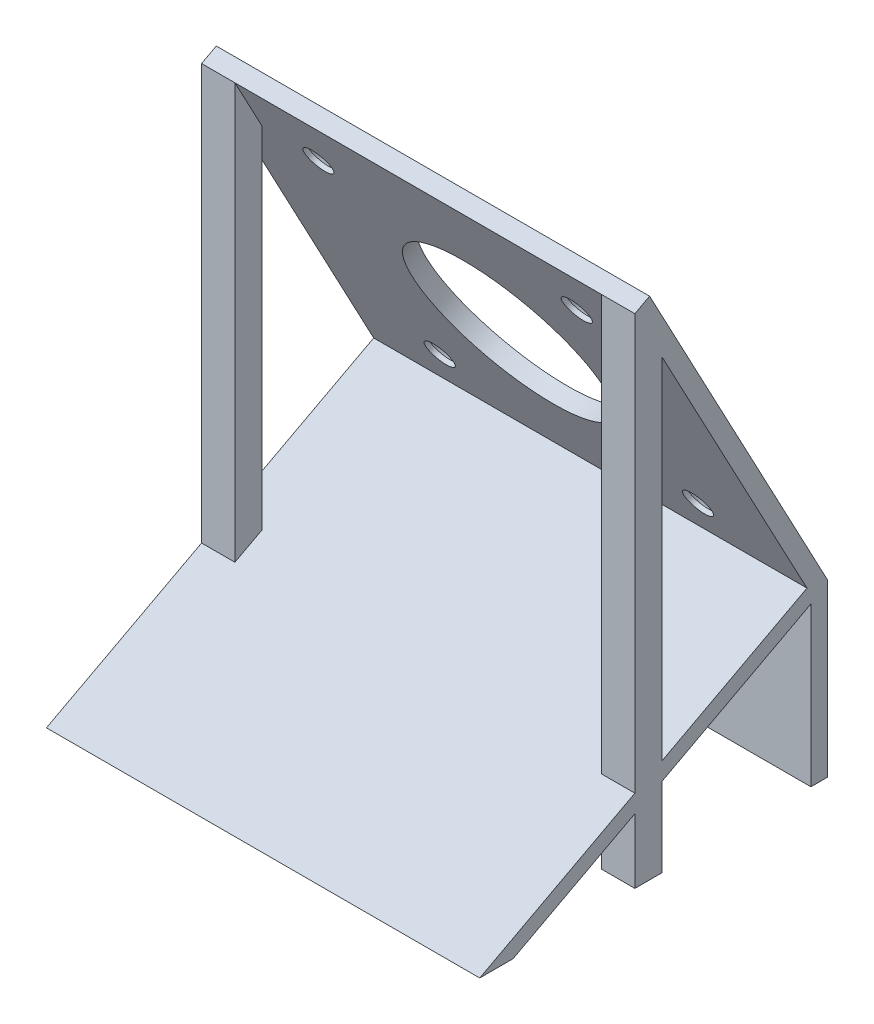
ISO-10303-21;
HEADER;
FILE_DESCRIPTION(('STEP AP214'),'2;1');
FILE_NAME('part.step','',(''),(''),'','','');
FILE_SCHEMA(('AUTOMOTIVE_DESIGN { 1 0 10303 214 1 1 1 1 }'));
ENDSEC;
DATA;
#1=APPLICATION_CONTEXT('core data for automotive mechanical design processes');
#2=APPLICATION_PROTOCOL_DEFINITION('international standard','automotive_design',2000,#1);
#3=PRODUCT_CONTEXT('',#1,'mechanical');
#4=PRODUCT('Part','Part','',(#3));
#5=PRODUCT_RELATED_PRODUCT_CATEGORY('part','',(#4));
#6=PRODUCT_DEFINITION_FORMATION('','',#4);
#7=PRODUCT_DEFINITION_CONTEXT('part definition',#1,'design');
#8=PRODUCT_DEFINITION('design','',#6,#7);
#9=PRODUCT_DEFINITION_SHAPE('','',#8);
#10=(LENGTH_UNIT() NAMED_UNIT(*) SI_UNIT(.MILLI.,.METRE.));
#11=(NAMED_UNIT(*) PLANE_ANGLE_UNIT() SI_UNIT($,.RADIAN.));
#12=(NAMED_UNIT(*) SI_UNIT($,.STERADIAN.) SOLID_ANGLE_UNIT());
#13=UNCERTAINTY_MEASURE_WITH_UNIT(LENGTH_MEASURE(1.E-05),#10,'distance_accuracy_value','');
#14=(GEOMETRIC_REPRESENTATION_CONTEXT(3) GLOBAL_UNCERTAINTY_ASSIGNED_CONTEXT((#13)) GLOBAL_UNIT_ASSIGNED_CONTEXT((#10,
#11,#12)) REPRESENTATION_CONTEXT('',''));
#15=CARTESIAN_POINT('',(0.,0.,0.));
#16=DIRECTION('',(0.,0.,1.));
#17=DIRECTION('',(1.,0.,0.));
#18=AXIS2_PLACEMENT_3D('',#15,#16,#17);
#19=CARTESIAN_POINT('',(-26.,5.,-50.));
#20=DIRECTION('',(1.,0.,0.));
#21=DIRECTION('',(0.,0.,-1.));
#22=AXIS2_PLACEMENT_3D('',#19,#20,#21);
#23=PLANE('',#22);
#24=DIRECTION('',(0.,-1.,0.));
#25=VECTOR('',#24,1.);
#26=CARTESIAN_POINT('',(-26.,5.,21.8722918875582));
#27=LINE('',#26,#25);
#28=CARTESIAN_POINT('',(-26.,58.6128923493257,21.8722918875582));
#29=VERTEX_POINT('',#28);
#30=CARTESIAN_POINT('',(-26.,16.6297038886675,21.8722918875582));
#31=VERTEX_POINT('',#30);
#32=EDGE_CURVE('E385',#29,#31,#27,.T.);
#33=ORIENTED_EDGE('',*,*,#32,.T.);
#34=DIRECTION('',(0.,0.469471562785889,-0.882947592858928));
#35=VECTOR('',#34,1.);
#36=CARTESIAN_POINT('',(-26.,25.8829475928589,4.46947156278588));
#37=LINE('',#36,#35);
#38=CARTESIAN_POINT('',(-26.,25.8829475928589,4.46947156278588));
#39=VERTEX_POINT('',#38);
#40=EDGE_CURVE('E235',#31,#39,#37,.T.);
#41=ORIENTED_EDGE('',*,*,#40,.T.);
#42=DIRECTION('',(0.,0.88294759285893,0.469471562785886));
#43=VECTOR('',#42,1.);
#44=CARTESIAN_POINT('',(-26.,25.,4.));
#45=LINE('',#44,#43);
#46=EDGE_CURVE('E250',#39,#29,#45,.T.);
#47=ORIENTED_EDGE('',*,*,#46,.T.);
#48=EDGE_LOOP('',(#33,#41,#47));
#49=FACE_BOUND('',#48,.T.);
#50=DIRECTION('',(0.,0.,1.));
#51=VECTOR('',#50,1.);
#52=CARTESIAN_POINT('',(-26.,5.,0.));
#53=LINE('',#52,#51);
#54=CARTESIAN_POINT('',(-26.,5.,39.7445837751164));
#55=VERTEX_POINT('',#54);
#56=CARTESIAN_POINT('',(-26.,5.,43.7445837751163));
#57=VERTEX_POINT('',#56);
#58=EDGE_CURVE('E200',#55,#57,#53,.T.);
#59=ORIENTED_EDGE('',*,*,#58,.T.);
#60=CARTESIAN_POINT('',(-26.,14.8995594483342,25.1262203253649));
#61=VERTEX_POINT('',#60);
#62=EDGE_CURVE('E231',#57,#61,#37,.T.);
#63=ORIENTED_EDGE('',*,*,#62,.T.);
#64=DIRECTION('',(0.,1.,0.));
#65=VECTOR('',#64,1.);
#66=CARTESIAN_POINT('',(-26.,64.7326416786518,25.1262203253649));
#67=LINE('',#66,#65);
#68=CARTESIAN_POINT('',(-26.,64.7326416786518,25.1262203253649));
#69=VERTEX_POINT('',#68);
#70=EDGE_CURVE('E387',#61,#69,#67,.T.);
#71=ORIENTED_EDGE('',*,*,#70,.T.);
#72=DIRECTION('',(0.,0.469471562785879,-0.882947592858933));
#73=VECTOR('',#72,1.);
#74=CARTESIAN_POINT('',(-26.,64.7326416786518,25.1262203253649));
#75=LINE('',#74,#73);
#76=CARTESIAN_POINT('',(-26.,65.6715848042236,23.360325139647));
#77=VERTEX_POINT('',#76);
#78=EDGE_CURVE('E259',#69,#77,#75,.T.);
#79=ORIENTED_EDGE('',*,*,#78,.T.);
#80=DIRECTION('',(0.,-0.88294759285893,-0.469471562785885));
#81=VECTOR('',#80,1.);
#82=CARTESIAN_POINT('',(-26.,65.6715848042236,23.360325139647));
#83=LINE('',#82,#81);
#84=CARTESIAN_POINT('',(-26.,25.4986560056863,2.));
#85=VERTEX_POINT('',#84);
#86=EDGE_CURVE('E262',#77,#85,#83,.T.);
#87=ORIENTED_EDGE('',*,*,#86,.T.);
#88=DIRECTION('',(0.,-1.,0.));
#89=VECTOR('',#88,1.);
#90=CARTESIAN_POINT('',(-26.,55.,1.99999999999999));
#91=LINE('',#90,#89);
#92=CARTESIAN_POINT('',(-26.,5.,1.99999999999999));
#93=VERTEX_POINT('',#92);
#94=EDGE_CURVE('E282',#85,#93,#91,.T.);
#95=ORIENTED_EDGE('',*,*,#94,.T.);
#96=CARTESIAN_POINT('',(-26.,5.,3.99999999999998));
#97=VERTEX_POINT('',#96);
#98=EDGE_CURVE('E435',#93,#97,#53,.T.);
#99=ORIENTED_EDGE('',*,*,#98,.T.);
#100=DIRECTION('',(0.,-1.,0.));
#101=VECTOR('',#100,1.);
#102=CARTESIAN_POINT('',(-26.,55.,3.99999999999998));
#103=LINE('',#102,#101);
#104=CARTESIAN_POINT('',(-26.,24.0057323240431,4.));
#105=VERTEX_POINT('',#104);
#106=EDGE_CURVE('E279',#105,#97,#103,.T.);
#107=ORIENTED_EDGE('',*,*,#106,.F.);
#108=DIRECTION('',(0.,-0.469471562785889,0.882947592858928));
#109=VECTOR('',#108,1.);
#110=CARTESIAN_POINT('',(-26.,5.,39.7445837751164));
#111=LINE('',#110,#109);
#112=CARTESIAN_POINT('',(-26.,14.5028661620216,21.8722918875582));
#113=VERTEX_POINT('',#112);
#114=EDGE_CURVE('E236',#105,#113,#111,.T.);
#115=ORIENTED_EDGE('',*,*,#114,.T.);
#116=CARTESIAN_POINT('',(-26.,5.,21.8722918875582));
#117=VERTEX_POINT('',#116);
#118=EDGE_CURVE('E369',#113,#117,#27,.T.);
#119=ORIENTED_EDGE('',*,*,#118,.T.);
#120=CARTESIAN_POINT('',(-26.,5.,25.1262203253649));
#121=VERTEX_POINT('',#120);
#122=EDGE_CURVE('E433',#117,#121,#53,.T.);
#123=ORIENTED_EDGE('',*,*,#122,.T.);
#124=CARTESIAN_POINT('',(-26.,12.7727217216883,25.1262203253649));
#125=VERTEX_POINT('',#124);
#126=EDGE_CURVE('E374',#121,#125,#67,.T.);
#127=ORIENTED_EDGE('',*,*,#126,.T.);
#128=EDGE_CURVE('E234',#125,#55,#111,.T.);
#129=ORIENTED_EDGE('',*,*,#128,.T.);
#130=EDGE_LOOP('',(#59,#63,#71,#79,#87,#95,#99,#107,#115,#119,#123,#127,#129));
#131=FACE_BOUND('',#130,.T.);
#132=ADVANCED_FACE('F33',(#49,#131),#23,.F.);
#133=CARTESIAN_POINT('',(26.,5.,-50.));
#134=DIRECTION('',(-1.,0.,0.));
#135=DIRECTION('',(0.,0.,1.));
#136=AXIS2_PLACEMENT_3D('',#133,#134,#135);
#137=PLANE('',#136);
#138=DIRECTION('',(0.,-0.469471562785889,0.882947592858928));
#139=VECTOR('',#138,1.);
#140=CARTESIAN_POINT('',(26.,25.8829475928589,4.46947156278588));
#141=LINE('',#140,#139);
#142=CARTESIAN_POINT('',(26.,14.8995594483342,25.1262203253649));
#143=VERTEX_POINT('',#142);
#144=CARTESIAN_POINT('',(26.,5.,43.7445837751164));
#145=VERTEX_POINT('',#144);
#146=EDGE_CURVE('E216',#143,#145,#141,.T.);
#147=ORIENTED_EDGE('',*,*,#146,.T.);
#148=DIRECTION('',(0.,0.,-1.));
#149=VECTOR('',#148,1.);
#150=CARTESIAN_POINT('',(26.,5.,0.));
#151=LINE('',#150,#149);
#152=CARTESIAN_POINT('',(26.,5.,39.7445837751163));
#153=VERTEX_POINT('',#152);
#154=EDGE_CURVE('E197',#145,#153,#151,.T.);
#155=ORIENTED_EDGE('',*,*,#154,.T.);
#156=DIRECTION('',(0.,0.469471562785889,-0.882947592858928));
#157=VECTOR('',#156,1.);
#158=CARTESIAN_POINT('',(26.,5.,39.7445837751164));
#159=LINE('',#158,#157);
#160=CARTESIAN_POINT('',(26.,12.7727217216883,25.1262203253649));
#161=VERTEX_POINT('',#160);
#162=EDGE_CURVE('E213',#153,#161,#159,.T.);
#163=ORIENTED_EDGE('',*,*,#162,.T.);
#164=DIRECTION('',(0.,1.,0.));
#165=VECTOR('',#164,1.);
#166=CARTESIAN_POINT('',(26.,64.7326416786518,25.1262203253648));
#167=LINE('',#166,#165);
#168=CARTESIAN_POINT('',(26.,5.,25.1262203253648));
#169=VERTEX_POINT('',#168);
#170=EDGE_CURVE('E343',#169,#161,#167,.T.);
#171=ORIENTED_EDGE('',*,*,#170,.F.);
#172=CARTESIAN_POINT('',(26.,5.,21.8722918875582));
#173=VERTEX_POINT('',#172);
#174=EDGE_CURVE('E218',#169,#173,#151,.T.);
#175=ORIENTED_EDGE('',*,*,#174,.T.);
#176=DIRECTION('',(0.,-1.,0.));
#177=VECTOR('',#176,1.);
#178=CARTESIAN_POINT('',(26.,5.,21.8722918875582));
#179=LINE('',#178,#177);
#180=CARTESIAN_POINT('',(26.,14.5028661620216,21.8722918875582));
#181=VERTEX_POINT('',#180);
#182=EDGE_CURVE('E342',#181,#173,#179,.T.);
#183=ORIENTED_EDGE('',*,*,#182,.F.);
#184=CARTESIAN_POINT('',(26.,24.0057323240431,3.99999999999999));
#185=VERTEX_POINT('',#184);
#186=EDGE_CURVE('E205',#181,#185,#159,.T.);
#187=ORIENTED_EDGE('',*,*,#186,.T.);
#188=DIRECTION('',(0.,-1.,0.));
#189=VECTOR('',#188,1.);
#190=CARTESIAN_POINT('',(26.,55.,3.99999999999998));
#191=LINE('',#190,#189);
#192=CARTESIAN_POINT('',(26.,5.,3.99999999999998));
#193=VERTEX_POINT('',#192);
#194=EDGE_CURVE('E276',#185,#193,#191,.T.);
#195=ORIENTED_EDGE('',*,*,#194,.T.);
#196=CARTESIAN_POINT('',(26.,5.,1.99999999999998));
#197=VERTEX_POINT('',#196);
#198=EDGE_CURVE('E220',#193,#197,#151,.T.);
#199=ORIENTED_EDGE('',*,*,#198,.T.);
#200=DIRECTION('',(0.,-1.,0.));
#201=VECTOR('',#200,1.);
#202=CARTESIAN_POINT('',(26.,55.,1.99999999999998));
#203=LINE('',#202,#201);
#204=CARTESIAN_POINT('',(26.,25.4986560056863,2.));
#205=VERTEX_POINT('',#204);
#206=EDGE_CURVE('E285',#205,#197,#203,.T.);
#207=ORIENTED_EDGE('',*,*,#206,.F.);
#208=DIRECTION('',(0.,0.88294759285893,0.469471562785885));
#209=VECTOR('',#208,1.);
#210=CARTESIAN_POINT('',(26.,65.6715848042236,23.360325139647));
#211=LINE('',#210,#209);
#212=CARTESIAN_POINT('',(26.,65.6715848042236,23.3603251396469));
#213=VERTEX_POINT('',#212);
#214=EDGE_CURVE('E253',#205,#213,#211,.T.);
#215=ORIENTED_EDGE('',*,*,#214,.T.);
#216=DIRECTION('',(0.,-0.469471562785879,0.882947592858933));
#217=VECTOR('',#216,1.);
#218=CARTESIAN_POINT('',(26.,64.7326416786518,25.1262203253649));
#219=LINE('',#218,#217);
#220=CARTESIAN_POINT('',(26.,64.7326416786518,25.1262203253648));
#221=VERTEX_POINT('',#220);
#222=EDGE_CURVE('E251',#213,#221,#219,.T.);
#223=ORIENTED_EDGE('',*,*,#222,.T.);
#224=EDGE_CURVE('E341',#143,#221,#167,.T.);
#225=ORIENTED_EDGE('',*,*,#224,.F.);
#226=EDGE_LOOP('',(#147,#155,#163,#171,#175,#183,#187,#195,#199,#207,#215,#223,#225));
#227=FACE_BOUND('',#226,.T.);
#228=CARTESIAN_POINT('',(26.,25.8829475928589,4.46947156278588));
#229=VERTEX_POINT('',#228);
#230=CARTESIAN_POINT('',(26.,16.6297038886675,21.8722918875582));
#231=VERTEX_POINT('',#230);
#232=EDGE_CURVE('E225',#229,#231,#141,.T.);
#233=ORIENTED_EDGE('',*,*,#232,.T.);
#234=CARTESIAN_POINT('',(26.,58.6128923493257,21.8722918875582));
#235=VERTEX_POINT('',#234);
#236=EDGE_CURVE('E338',#235,#231,#179,.T.);
#237=ORIENTED_EDGE('',*,*,#236,.F.);
#238=DIRECTION('',(0.,-0.88294759285893,-0.469471562785886));
#239=VECTOR('',#238,1.);
#240=CARTESIAN_POINT('',(26.,25.,3.99999999999999));
#241=LINE('',#240,#239);
#242=EDGE_CURVE('E256',#235,#229,#241,.T.);
#243=ORIENTED_EDGE('',*,*,#242,.T.);
#244=EDGE_LOOP('',(#233,#237,#243));
#245=FACE_BOUND('',#244,.T.);
#246=ADVANCED_FACE('F210',(#227,#245),#137,.F.);
#247=CARTESIAN_POINT('',(26.,55.,1.99999999999998));
#248=DIRECTION('',(0.,0.,1.));
#249=DIRECTION('',(1.,0.,0.));
#250=AXIS2_PLACEMENT_3D('',#247,#248,#249);
#251=PLANE('',#250);
#252=ORIENTED_EDGE('',*,*,#94,.F.);
#253=DIRECTION('',(-1.,0.,0.));
#254=VECTOR('',#253,1.);
#255=CARTESIAN_POINT('',(55.5690598002511,25.4986560056863,1.99999999999999));
#256=LINE('',#255,#254);
#257=EDGE_CURVE('E247',#205,#85,#256,.T.);
#258=ORIENTED_EDGE('',*,*,#257,.F.);
#259=ORIENTED_EDGE('',*,*,#206,.T.);
#260=DIRECTION('',(-1.,0.,0.));
#261=VECTOR('',#260,1.);
#262=CARTESIAN_POINT('',(26.,5.,1.99999999999998));
#263=LINE('',#262,#261);
#264=EDGE_CURVE('E270',#197,#93,#263,.T.);
#265=ORIENTED_EDGE('',*,*,#264,.T.);
#266=EDGE_LOOP('',(#252,#258,#259,#265));
#267=FACE_BOUND('',#266,.T.);
#268=ADVANCED_FACE('F487',(#267),#251,.F.);
#269=CARTESIAN_POINT('',(-26.,55.,3.99999999999998));
#270=DIRECTION('',(0.,0.,-1.));
#271=DIRECTION('',(-1.,0.,0.));
#272=AXIS2_PLACEMENT_3D('',#269,#270,#271);
#273=PLANE('',#272);
#274=ORIENTED_EDGE('',*,*,#194,.F.);
#275=DIRECTION('',(-1.,0.,0.));
#276=VECTOR('',#275,1.);
#277=CARTESIAN_POINT('',(70.8968756109302,24.0057323240431,3.99999999999999));
#278=LINE('',#277,#276);
#279=EDGE_CURVE('E206',#185,#105,#278,.T.);
#280=ORIENTED_EDGE('',*,*,#279,.T.);
#281=ORIENTED_EDGE('',*,*,#106,.T.);
#282=DIRECTION('',(1.,0.,0.));
#283=VECTOR('',#282,1.);
#284=CARTESIAN_POINT('',(-26.,5.,3.99999999999998));
#285=LINE('',#284,#283);
#286=EDGE_CURVE('E273',#97,#193,#285,.T.);
#287=ORIENTED_EDGE('',*,*,#286,.T.);
#288=EDGE_LOOP('',(#274,#280,#281,#287));
#289=FACE_BOUND('',#288,.T.);
#290=ADVANCED_FACE('F491',(#289),#273,.F.);
#291=CARTESIAN_POINT('',(71.8311574774521,65.6715848042236,23.3603251396469));
#292=DIRECTION('',(0.,0.469471562785885,-0.88294759285893));
#293=DIRECTION('',(0.,0.88294759285893,0.469471562785885));
#294=AXIS2_PLACEMENT_3D('',#291,#292,#293);
#295=PLANE('',#294);
#296=CARTESIAN_POINT('',(15.5,59.0500711960537,19.8396039023082));
#297=DIRECTION('',(0.,0.469471562785885,-0.88294759285893));
#298=DIRECTION('',(0.,0.88294759285893,0.469471562785885));
#299=AXIS2_PLACEMENT_3D('',#296,#297,#298);
#300=CIRCLE('',#299,3.15);
#301=CARTESIAN_POINT('',(15.5,61.8313561135593,21.3184393250838));
#302=VERTEX_POINT('',#301);
#303=EDGE_CURVE('E439',#302,#302,#300,.T.);
#304=ORIENTED_EDGE('',*,*,#303,.F.);
#305=EDGE_LOOP('',(#304));
#306=FACE_BOUND('',#305,.T.);
#307=CARTESIAN_POINT('',(-15.5,59.0500711960537,19.8396039023082));
#308=DIRECTION('',(0.,0.469471562785885,-0.88294759285893));
#309=DIRECTION('',(0.,0.88294759285893,0.469471562785885));
#310=AXIS2_PLACEMENT_3D('',#307,#308,#309);
#311=CIRCLE('',#310,3.15);
#312=CARTESIAN_POINT('',(-15.5,61.8313561135593,21.3184393250838));
#313=VERTEX_POINT('',#312);
#314=EDGE_CURVE('E319',#313,#313,#311,.T.);
#315=ORIENTED_EDGE('',*,*,#314,.F.);
#316=EDGE_LOOP('',(#315));
#317=FACE_BOUND('',#316,.T.);
#318=CARTESIAN_POINT('',(-15.5,31.6786958174268,5.2859854559458));
#319=DIRECTION('',(0.,0.469471562785885,-0.88294759285893));
#320=DIRECTION('',(0.,0.88294759285893,0.469471562785885));
#321=AXIS2_PLACEMENT_3D('',#318,#319,#320);
#322=CIRCLE('',#321,3.15);
#323=CARTESIAN_POINT('',(-15.5,34.4599807349325,6.76482087872134));
#324=VERTEX_POINT('',#323);
#325=EDGE_CURVE('E312',#324,#324,#322,.T.);
#326=ORIENTED_EDGE('',*,*,#325,.F.);
#327=EDGE_LOOP('',(#326));
#328=FACE_BOUND('',#327,.T.);
#329=CARTESIAN_POINT('',(15.5,31.6786958174268,5.2859854559458));
#330=DIRECTION('',(0.,0.469471562785885,-0.88294759285893));
#331=DIRECTION('',(0.,0.88294759285893,0.469471562785885));
#332=AXIS2_PLACEMENT_3D('',#329,#330,#331);
#333=CIRCLE('',#332,3.15);
#334=CARTESIAN_POINT('',(15.5,34.4599807349325,6.76482087872133));
#335=VERTEX_POINT('',#334);
#336=EDGE_CURVE('E308',#335,#335,#333,.T.);
#337=ORIENTED_EDGE('',*,*,#336,.F.);
#338=EDGE_LOOP('',(#337));
#339=FACE_BOUND('',#338,.T.);
#340=CARTESIAN_POINT('',(0.,45.3637901684682,12.5624791955716));
#341=DIRECTION('',(0.,0.469471562785885,-0.88294759285893));
#342=DIRECTION('',(0.,0.88294759285893,0.469471562785885));
#343=AXIS2_PLACEMENT_3D('',#340,#341,#342);
#344=CIRCLE('',#343,11.5);
#345=CARTESIAN_POINT('',(0.,55.5176874863459,17.9614021676093));
#346=VERTEX_POINT('',#345);
#347=EDGE_CURVE('E304',#346,#346,#344,.T.);
#348=ORIENTED_EDGE('',*,*,#347,.F.);
#349=EDGE_LOOP('',(#348));
#350=FACE_BOUND('',#349,.T.);
#351=ORIENTED_EDGE('',*,*,#214,.F.);
#352=ORIENTED_EDGE('',*,*,#257,.T.);
#353=ORIENTED_EDGE('',*,*,#86,.F.);
#354=DIRECTION('',(-1.,0.,0.));
#355=VECTOR('',#354,1.);
#356=CARTESIAN_POINT('',(71.8311574774521,65.6715848042236,23.3603251396469));
#357=LINE('',#356,#355);
#358=EDGE_CURVE('E254',#213,#77,#357,.T.);
#359=ORIENTED_EDGE('',*,*,#358,.F.);
#360=EDGE_LOOP('',(#351,#352,#353,#359));
#361=FACE_BOUND('',#360,.T.);
#362=ADVANCED_FACE('F496',(#306,#317,#328,#339,#350,#361),#295,.T.);
#363=CARTESIAN_POINT('',(71.8311574774521,64.7326416786518,25.1262203253648));
#364=DIRECTION('',(0.,0.882947592858933,0.469471562785879));
#365=DIRECTION('',(0.,-0.469471562785879,0.882947592858933));
#366=AXIS2_PLACEMENT_3D('',#363,#364,#365);
#367=PLANE('',#366);
#368=ORIENTED_EDGE('',*,*,#222,.F.);
#369=ORIENTED_EDGE('',*,*,#358,.T.);
#370=ORIENTED_EDGE('',*,*,#78,.F.);
#371=DIRECTION('',(-1.,0.,0.));
#372=VECTOR('',#371,1.);
#373=CARTESIAN_POINT('',(-22.,64.7326416786518,25.1262203253649));
#374=LINE('',#373,#372);
#375=CARTESIAN_POINT('',(-22.,64.7326416786518,25.1262203253649));
#376=VERTEX_POINT('',#375);
#377=EDGE_CURVE('E389',#376,#69,#374,.T.);
#378=ORIENTED_EDGE('',*,*,#377,.F.);
#379=DIRECTION('',(-1.,0.,0.));
#380=VECTOR('',#379,1.);
#381=CARTESIAN_POINT('',(71.8311574774521,64.7326416786518,25.1262203253648));
#382=LINE('',#381,#380);
#383=CARTESIAN_POINT('',(22.,64.7326416786518,25.1262203253648));
#384=VERTEX_POINT('',#383);
#385=EDGE_CURVE('E264',#384,#376,#382,.T.);
#386=ORIENTED_EDGE('',*,*,#385,.F.);
#387=EDGE_CURVE('E266',#221,#384,#382,.T.);
#388=ORIENTED_EDGE('',*,*,#387,.F.);
#389=EDGE_LOOP('',(#368,#369,#370,#378,#386,#388));
#390=FACE_BOUND('',#389,.T.);
#391=ADVANCED_FACE('F455',(#390),#367,.T.);
#392=CARTESIAN_POINT('',(71.8311574774521,25.,3.99999999999999));
#393=DIRECTION('',(0.,-0.469471562785886,0.88294759285893));
#394=DIRECTION('',(0.,-0.88294759285893,-0.469471562785886));
#395=AXIS2_PLACEMENT_3D('',#392,#393,#394);
#396=PLANE('',#395);
#397=CARTESIAN_POINT('',(15.5,58.1111280704819,21.6054990880261));
#398=DIRECTION('',(0.,-0.469471562785886,0.88294759285893));
#399=DIRECTION('',(0.,-0.88294759285893,-0.469471562785886));
#400=AXIS2_PLACEMENT_3D('',#397,#398,#399);
#401=CIRCLE('',#400,1.7);
#402=CARTESIAN_POINT('',(15.5,56.6101171626217,20.8073974312901));
#403=VERTEX_POINT('',#402);
#404=EDGE_CURVE('E36',#403,#403,#401,.T.);
#405=ORIENTED_EDGE('',*,*,#404,.F.);
#406=EDGE_LOOP('',(#405));
#407=FACE_BOUND('',#406,.T.);
#408=CARTESIAN_POINT('',(-15.5,58.1111280704819,21.6054990880261));
#409=DIRECTION('',(0.,-0.469471562785886,0.88294759285893));
#410=DIRECTION('',(0.,-0.88294759285893,-0.469471562785886));
#411=AXIS2_PLACEMENT_3D('',#408,#409,#410);
#412=CIRCLE('',#411,1.7);
#413=CARTESIAN_POINT('',(-15.5,56.6101171626217,20.8073974312901));
#414=VERTEX_POINT('',#413);
#415=EDGE_CURVE('E310',#414,#414,#412,.T.);
#416=ORIENTED_EDGE('',*,*,#415,.F.);
#417=EDGE_LOOP('',(#416));
#418=FACE_BOUND('',#417,.T.);
#419=CARTESIAN_POINT('',(-15.5,30.7397526918551,7.05188064166365));
#420=DIRECTION('',(0.,-0.469471562785886,0.88294759285893));
#421=DIRECTION('',(0.,-0.88294759285893,-0.469471562785886));
#422=AXIS2_PLACEMENT_3D('',#419,#420,#421);
#423=CIRCLE('',#422,1.7);
#424=CARTESIAN_POINT('',(-15.5,29.2387417839949,6.25377898492764));
#425=VERTEX_POINT('',#424);
#426=EDGE_CURVE('E306',#425,#425,#423,.T.);
#427=ORIENTED_EDGE('',*,*,#426,.F.);
#428=EDGE_LOOP('',(#427));
#429=FACE_BOUND('',#428,.T.);
#430=CARTESIAN_POINT('',(15.5,30.7397526918551,7.05188064166365));
#431=DIRECTION('',(0.,-0.469471562785886,0.88294759285893));
#432=DIRECTION('',(0.,-0.88294759285893,-0.469471562785886));
#433=AXIS2_PLACEMENT_3D('',#430,#431,#432);
#434=CIRCLE('',#433,1.7);
#435=CARTESIAN_POINT('',(15.5,29.2387417839949,6.25377898492764));
#436=VERTEX_POINT('',#435);
#437=EDGE_CURVE('E301',#436,#436,#434,.T.);
#438=ORIENTED_EDGE('',*,*,#437,.F.);
#439=EDGE_LOOP('',(#438));
#440=FACE_BOUND('',#439,.T.);
#441=CARTESIAN_POINT('',(0.,44.4248470428965,14.3283743812895));
#442=DIRECTION('',(0.,-0.469471562785886,0.88294759285893));
#443=DIRECTION('',(0.,-0.88294759285893,-0.469471562785886));
#444=AXIS2_PLACEMENT_3D('',#441,#442,#443);
#445=CIRCLE('',#444,11.5);
#446=CARTESIAN_POINT('',(0.,34.2709497250188,8.92945140925179));
#447=VERTEX_POINT('',#446);
#448=EDGE_CURVE('E335',#447,#447,#445,.F.);
#449=ORIENTED_EDGE('',*,*,#448,.T.);
#450=EDGE_LOOP('',(#449));
#451=FACE_BOUND('',#450,.T.);
#452=DIRECTION('',(-1.,0.,0.));
#453=VECTOR('',#452,1.);
#454=CARTESIAN_POINT('',(26.,58.6128923493257,21.8722918875582));
#455=LINE('',#454,#453);
#456=CARTESIAN_POINT('',(22.,58.6128923493257,21.8722918875582));
#457=VERTEX_POINT('',#456);
#458=EDGE_CURVE('E345',#235,#457,#455,.T.);
#459=ORIENTED_EDGE('',*,*,#458,.T.);
#460=DIRECTION('',(0.,-0.882947592858929,-0.469471562785886));
#461=VECTOR('',#460,1.);
#462=CARTESIAN_POINT('',(22.,58.6128923493257,21.8722918875582));
#463=LINE('',#462,#461);
#464=EDGE_CURVE('E57',#384,#457,#463,.T.);
#465=ORIENTED_EDGE('',*,*,#464,.F.);
#466=ORIENTED_EDGE('',*,*,#385,.T.);
#467=DIRECTION('',(0.,-0.882947592858929,-0.469471562785886));
#468=VECTOR('',#467,1.);
#469=CARTESIAN_POINT('',(-22.,58.6128923493257,21.8722918875582));
#470=LINE('',#469,#468);
#471=CARTESIAN_POINT('',(-22.,58.6128923493257,21.8722918875582));
#472=VERTEX_POINT('',#471);
#473=EDGE_CURVE('E370',#376,#472,#470,.T.);
#474=ORIENTED_EDGE('',*,*,#473,.T.);
#475=DIRECTION('',(-1.,0.,0.));
#476=VECTOR('',#475,1.);
#477=CARTESIAN_POINT('',(-22.,58.6128923493257,21.8722918875582));
#478=LINE('',#477,#476);
#479=EDGE_CURVE('E384',#472,#29,#478,.T.);
#480=ORIENTED_EDGE('',*,*,#479,.T.);
#481=ORIENTED_EDGE('',*,*,#46,.F.);
#482=DIRECTION('',(-1.,0.,0.));
#483=VECTOR('',#482,1.);
#484=CARTESIAN_POINT('',(70.8968756109302,25.8829475928589,4.46947156278587));
#485=LINE('',#484,#483);
#486=EDGE_CURVE('E242',#229,#39,#485,.T.);
#487=ORIENTED_EDGE('',*,*,#486,.F.);
#488=ORIENTED_EDGE('',*,*,#242,.F.);
#489=EDGE_LOOP('',(#459,#465,#466,#474,#480,#481,#487,#488));
#490=FACE_BOUND('',#489,.T.);
#491=ADVANCED_FACE('F418',(#407,#418,#429,#440,#451,#490),#396,.T.);
#492=CARTESIAN_POINT('',(70.8968756109302,5.,39.7445837751164));
#493=DIRECTION('',(0.,-0.882947592858928,-0.469471562785889));
#494=DIRECTION('',(0.,0.469471562785889,-0.882947592858928));
#495=AXIS2_PLACEMENT_3D('',#492,#493,#494);
#496=PLANE('',#495);
#497=DIRECTION('',(-1.,0.,0.));
#498=VECTOR('',#497,1.);
#499=CARTESIAN_POINT('',(70.8968756109302,12.7727217216883,25.1262203253648));
#500=LINE('',#499,#498);
#501=CARTESIAN_POINT('',(22.,12.7727217216883,25.1262203253649));
#502=VERTEX_POINT('',#501);
#503=EDGE_CURVE('E223',#161,#502,#500,.T.);
#504=ORIENTED_EDGE('',*,*,#503,.F.);
#505=ORIENTED_EDGE('',*,*,#162,.F.);
#506=DIRECTION('',(-1.,0.,0.));
#507=VECTOR('',#506,1.);
#508=CARTESIAN_POINT('',(70.8968756109302,5.,39.7445837751164));
#509=LINE('',#508,#507);
#510=EDGE_CURVE('E194',#153,#55,#509,.T.);
#511=ORIENTED_EDGE('',*,*,#510,.T.);
#512=ORIENTED_EDGE('',*,*,#128,.F.);
#513=DIRECTION('',(-1.,0.,0.));
#514=VECTOR('',#513,1.);
#515=CARTESIAN_POINT('',(70.8968756109302,12.7727217216883,25.1262203253648));
#516=LINE('',#515,#514);
#517=CARTESIAN_POINT('',(-22.,12.7727217216883,25.1262203253649));
#518=VERTEX_POINT('',#517);
#519=EDGE_CURVE('E229',#518,#125,#516,.T.);
#520=ORIENTED_EDGE('',*,*,#519,.F.);
#521=DIRECTION('',(0.,0.469471562785889,-0.882947592858928));
#522=VECTOR('',#521,1.);
#523=CARTESIAN_POINT('',(-22.,5.,39.7445837751164));
#524=LINE('',#523,#522);
#525=CARTESIAN_POINT('',(-22.,14.5028661620216,21.8722918875582));
#526=VERTEX_POINT('',#525);
#527=EDGE_CURVE('E391',#518,#526,#524,.T.);
#528=ORIENTED_EDGE('',*,*,#527,.T.);
#529=DIRECTION('',(1.,0.,0.));
#530=VECTOR('',#529,1.);
#531=CARTESIAN_POINT('',(70.8968756109302,14.5028661620216,21.8722918875582));
#532=LINE('',#531,#530);
#533=EDGE_CURVE('E400',#113,#526,#532,.T.);
#534=ORIENTED_EDGE('',*,*,#533,.F.);
#535=ORIENTED_EDGE('',*,*,#114,.F.);
#536=ORIENTED_EDGE('',*,*,#279,.F.);
#537=ORIENTED_EDGE('',*,*,#186,.F.);
#538=DIRECTION('',(1.,0.,0.));
#539=VECTOR('',#538,1.);
#540=CARTESIAN_POINT('',(70.8968756109302,14.5028661620216,21.8722918875582));
#541=LINE('',#540,#539);
#542=CARTESIAN_POINT('',(22.,14.5028661620216,21.8722918875582));
#543=VERTEX_POINT('',#542);
#544=EDGE_CURVE('E365',#543,#181,#541,.T.);
#545=ORIENTED_EDGE('',*,*,#544,.F.);
#546=DIRECTION('',(0.,0.469471562785889,-0.882947592858928));
#547=VECTOR('',#546,1.);
#548=CARTESIAN_POINT('',(22.,5.,39.7445837751164));
#549=LINE('',#548,#547);
#550=EDGE_CURVE('E358',#502,#543,#549,.T.);
#551=ORIENTED_EDGE('',*,*,#550,.F.);
#552=EDGE_LOOP('',(#504,#505,#511,#512,#520,#528,#534,#535,#536,#537,#545,#551));
#553=FACE_BOUND('',#552,.T.);
#554=ADVANCED_FACE('F221',(#553),#496,.T.);
#555=CARTESIAN_POINT('',(70.8968756109302,25.8829475928589,4.46947156278587));
#556=DIRECTION('',(0.,0.882947592858928,0.469471562785889));
#557=DIRECTION('',(0.,-0.469471562785889,0.882947592858928));
#558=AXIS2_PLACEMENT_3D('',#555,#556,#557);
#559=PLANE('',#558);
#560=DIRECTION('',(1.,0.,0.));
#561=VECTOR('',#560,1.);
#562=CARTESIAN_POINT('',(70.8968756109302,14.8995594483342,25.1262203253648));
#563=LINE('',#562,#561);
#564=CARTESIAN_POINT('',(22.,14.8995594483342,25.1262203253648));
#565=VERTEX_POINT('',#564);
#566=EDGE_CURVE('E11',#565,#143,#563,.T.);
#567=ORIENTED_EDGE('',*,*,#566,.F.);
#568=DIRECTION('',(0.,-0.469471562785889,0.882947592858928));
#569=VECTOR('',#568,1.);
#570=CARTESIAN_POINT('',(22.,25.8829475928589,4.46947156278587));
#571=LINE('',#570,#569);
#572=CARTESIAN_POINT('',(22.,16.6297038886675,21.8722918875582));
#573=VERTEX_POINT('',#572);
#574=EDGE_CURVE('E296',#573,#565,#571,.T.);
#575=ORIENTED_EDGE('',*,*,#574,.F.);
#576=DIRECTION('',(-1.,0.,0.));
#577=VECTOR('',#576,1.);
#578=CARTESIAN_POINT('',(70.8968756109302,16.6297038886675,21.8722918875582));
#579=LINE('',#578,#577);
#580=EDGE_CURVE('E41',#231,#573,#579,.T.);
#581=ORIENTED_EDGE('',*,*,#580,.F.);
#582=ORIENTED_EDGE('',*,*,#232,.F.);
#583=ORIENTED_EDGE('',*,*,#486,.T.);
#584=ORIENTED_EDGE('',*,*,#40,.F.);
#585=DIRECTION('',(-1.,0.,0.));
#586=VECTOR('',#585,1.);
#587=CARTESIAN_POINT('',(70.8968756109302,16.6297038886675,21.8722918875582));
#588=LINE('',#587,#586);
#589=CARTESIAN_POINT('',(-22.,16.6297038886675,21.8722918875582));
#590=VERTEX_POINT('',#589);
#591=EDGE_CURVE('E291',#590,#31,#588,.T.);
#592=ORIENTED_EDGE('',*,*,#591,.F.);
#593=DIRECTION('',(0.,-0.469471562785889,0.882947592858928));
#594=VECTOR('',#593,1.);
#595=CARTESIAN_POINT('',(-22.,25.8829475928589,4.46947156278587));
#596=LINE('',#595,#594);
#597=CARTESIAN_POINT('',(-22.,14.8995594483342,25.1262203253649));
#598=VERTEX_POINT('',#597);
#599=EDGE_CURVE('E288',#590,#598,#596,.T.);
#600=ORIENTED_EDGE('',*,*,#599,.T.);
#601=DIRECTION('',(1.,0.,0.));
#602=VECTOR('',#601,1.);
#603=CARTESIAN_POINT('',(70.8968756109302,14.8995594483342,25.1262203253648));
#604=LINE('',#603,#602);
#605=EDGE_CURVE('E294',#61,#598,#604,.T.);
#606=ORIENTED_EDGE('',*,*,#605,.F.);
#607=ORIENTED_EDGE('',*,*,#62,.F.);
#608=DIRECTION('',(-1.,0.,0.));
#609=VECTOR('',#608,1.);
#610=CARTESIAN_POINT('',(70.8968756109302,5.,43.7445837751164));
#611=LINE('',#610,#609);
#612=EDGE_CURVE('E238',#145,#57,#611,.T.);
#613=ORIENTED_EDGE('',*,*,#612,.F.);
#614=ORIENTED_EDGE('',*,*,#146,.F.);
#615=EDGE_LOOP('',(#567,#575,#581,#582,#583,#584,#592,#600,#606,#607,#613,#614));
#616=FACE_BOUND('',#615,.T.);
#617=ADVANCED_FACE('F417',(#616),#559,.T.);
#618=CARTESIAN_POINT('',(-22.,0.,0.));
#619=DIRECTION('',(-1.,0.,0.));
#620=DIRECTION('',(0.,0.,1.));
#621=AXIS2_PLACEMENT_3D('',#618,#619,#620);
#622=PLANE('',#621);
#623=ORIENTED_EDGE('',*,*,#599,.F.);
#624=DIRECTION('',(0.,-1.,0.));
#625=VECTOR('',#624,1.);
#626=CARTESIAN_POINT('',(-22.,5.,21.8722918875582));
#627=LINE('',#626,#625);
#628=EDGE_CURVE('E375',#472,#590,#627,.T.);
#629=ORIENTED_EDGE('',*,*,#628,.F.);
#630=ORIENTED_EDGE('',*,*,#473,.F.);
#631=DIRECTION('',(0.,1.,0.));
#632=VECTOR('',#631,1.);
#633=CARTESIAN_POINT('',(-22.,64.7326416786518,25.1262203253649));
#634=LINE('',#633,#632);
#635=EDGE_CURVE('E380',#598,#376,#634,.T.);
#636=ORIENTED_EDGE('',*,*,#635,.F.);
#637=EDGE_LOOP('',(#623,#629,#630,#636));
#638=FACE_BOUND('',#637,.T.);
#639=ADVANCED_FACE('F424',(#638),#622,.F.);
#640=CARTESIAN_POINT('',(-22.,5.,21.8722918875582));
#641=DIRECTION('',(0.,0.,-1.));
#642=DIRECTION('',(-1.,0.,0.));
#643=AXIS2_PLACEMENT_3D('',#640,#641,#642);
#644=PLANE('',#643);
#645=ORIENTED_EDGE('',*,*,#628,.T.);
#646=ORIENTED_EDGE('',*,*,#591,.T.);
#647=ORIENTED_EDGE('',*,*,#32,.F.);
#648=ORIENTED_EDGE('',*,*,#479,.F.);
#649=EDGE_LOOP('',(#645,#646,#647,#648));
#650=FACE_BOUND('',#649,.T.);
#651=ADVANCED_FACE('F422',(#650),#644,.T.);
#652=CARTESIAN_POINT('',(-22.,64.7326416786518,25.1262203253649));
#653=DIRECTION('',(0.,0.,1.));
#654=DIRECTION('',(1.,0.,0.));
#655=AXIS2_PLACEMENT_3D('',#652,#653,#654);
#656=PLANE('',#655);
#657=ORIENTED_EDGE('',*,*,#70,.F.);
#658=ORIENTED_EDGE('',*,*,#605,.T.);
#659=ORIENTED_EDGE('',*,*,#635,.T.);
#660=ORIENTED_EDGE('',*,*,#377,.T.);
#661=EDGE_LOOP('',(#657,#658,#659,#660));
#662=FACE_BOUND('',#661,.T.);
#663=ADVANCED_FACE('F511',(#662),#656,.T.);
#664=CARTESIAN_POINT('',(-22.,5.,25.1262203253649));
#665=VERTEX_POINT('',#664);
#666=EDGE_CURVE('E381',#665,#518,#634,.T.);
#667=ORIENTED_EDGE('',*,*,#666,.T.);
#668=ORIENTED_EDGE('',*,*,#519,.T.);
#669=ORIENTED_EDGE('',*,*,#126,.F.);
#670=DIRECTION('',(-1.,0.,0.));
#671=VECTOR('',#670,1.);
#672=CARTESIAN_POINT('',(-22.,5.,25.1262203253649));
#673=LINE('',#672,#671);
#674=EDGE_CURVE('E392',#665,#121,#673,.T.);
#675=ORIENTED_EDGE('',*,*,#674,.F.);
#676=EDGE_LOOP('',(#667,#668,#669,#675));
#677=FACE_BOUND('',#676,.T.);
#678=ADVANCED_FACE('F515',(#677),#656,.T.);
#679=ORIENTED_EDGE('',*,*,#118,.F.);
#680=ORIENTED_EDGE('',*,*,#533,.T.);
#681=CARTESIAN_POINT('',(-22.,5.,21.8722918875582));
#682=VERTEX_POINT('',#681);
#683=EDGE_CURVE('E373',#526,#682,#627,.T.);
#684=ORIENTED_EDGE('',*,*,#683,.T.);
#685=DIRECTION('',(-1.,0.,0.));
#686=VECTOR('',#685,1.);
#687=CARTESIAN_POINT('',(-22.,5.,21.8722918875582));
#688=LINE('',#687,#686);
#689=EDGE_CURVE('E394',#682,#117,#688,.T.);
#690=ORIENTED_EDGE('',*,*,#689,.T.);
#691=EDGE_LOOP('',(#679,#680,#684,#690));
#692=FACE_BOUND('',#691,.T.);
#693=ADVANCED_FACE('F512',(#692),#644,.T.);
#694=ORIENTED_EDGE('',*,*,#527,.F.);
#695=ORIENTED_EDGE('',*,*,#666,.F.);
#696=DIRECTION('',(0.,0.,1.));
#697=VECTOR('',#696,1.);
#698=CARTESIAN_POINT('',(-22.,5.,25.1262203253649));
#699=LINE('',#698,#697);
#700=EDGE_CURVE('E378',#682,#665,#699,.T.);
#701=ORIENTED_EDGE('',*,*,#700,.F.);
#702=ORIENTED_EDGE('',*,*,#683,.F.);
#703=EDGE_LOOP('',(#694,#695,#701,#702));
#704=FACE_BOUND('',#703,.T.);
#705=ADVANCED_FACE('F518',(#704),#622,.F.);
#706=CARTESIAN_POINT('',(22.,0.,0.));
#707=DIRECTION('',(-1.,0.,0.));
#708=DIRECTION('',(0.,0.,1.));
#709=AXIS2_PLACEMENT_3D('',#706,#707,#708);
#710=PLANE('',#709);
#711=DIRECTION('',(0.,-1.,0.));
#712=VECTOR('',#711,1.);
#713=CARTESIAN_POINT('',(22.,5.,21.8722918875582));
#714=LINE('',#713,#712);
#715=EDGE_CURVE('E348',#457,#573,#714,.T.);
#716=ORIENTED_EDGE('',*,*,#715,.T.);
#717=ORIENTED_EDGE('',*,*,#574,.T.);
#718=DIRECTION('',(0.,1.,0.));
#719=VECTOR('',#718,1.);
#720=CARTESIAN_POINT('',(22.,64.7326416786518,25.1262203253648));
#721=LINE('',#720,#719);
#722=EDGE_CURVE('E353',#565,#384,#721,.T.);
#723=ORIENTED_EDGE('',*,*,#722,.T.);
#724=ORIENTED_EDGE('',*,*,#464,.T.);
#725=EDGE_LOOP('',(#716,#717,#723,#724));
#726=FACE_BOUND('',#725,.T.);
#727=ADVANCED_FACE('F481',(#726),#710,.T.);
#728=CARTESIAN_POINT('',(26.,5.,21.8722918875582));
#729=DIRECTION('',(0.,0.,-1.));
#730=DIRECTION('',(-1.,0.,0.));
#731=AXIS2_PLACEMENT_3D('',#728,#729,#730);
#732=PLANE('',#731);
#733=ORIENTED_EDGE('',*,*,#236,.T.);
#734=ORIENTED_EDGE('',*,*,#580,.T.);
#735=ORIENTED_EDGE('',*,*,#715,.F.);
#736=ORIENTED_EDGE('',*,*,#458,.F.);
#737=EDGE_LOOP('',(#733,#734,#735,#736));
#738=FACE_BOUND('',#737,.T.);
#739=ADVANCED_FACE('F519',(#738),#732,.T.);
#740=CARTESIAN_POINT('',(26.,64.7326416786518,25.1262203253648));
#741=DIRECTION('',(0.,0.,1.));
#742=DIRECTION('',(1.,0.,0.));
#743=AXIS2_PLACEMENT_3D('',#740,#741,#742);
#744=PLANE('',#743);
#745=ORIENTED_EDGE('',*,*,#722,.F.);
#746=ORIENTED_EDGE('',*,*,#566,.T.);
#747=ORIENTED_EDGE('',*,*,#224,.T.);
#748=ORIENTED_EDGE('',*,*,#387,.T.);
#749=EDGE_LOOP('',(#745,#746,#747,#748));
#750=FACE_BOUND('',#749,.T.);
#751=ADVANCED_FACE('F522',(#750),#744,.T.);
#752=ORIENTED_EDGE('',*,*,#170,.T.);
#753=ORIENTED_EDGE('',*,*,#503,.T.);
#754=CARTESIAN_POINT('',(22.,5.,25.1262203253648));
#755=VERTEX_POINT('',#754);
#756=EDGE_CURVE('E354',#755,#502,#721,.T.);
#757=ORIENTED_EDGE('',*,*,#756,.F.);
#758=DIRECTION('',(-1.,0.,0.));
#759=VECTOR('',#758,1.);
#760=CARTESIAN_POINT('',(26.,5.,25.1262203253648));
#761=LINE('',#760,#759);
#762=EDGE_CURVE('E49',#169,#755,#761,.T.);
#763=ORIENTED_EDGE('',*,*,#762,.F.);
#764=EDGE_LOOP('',(#752,#753,#757,#763));
#765=FACE_BOUND('',#764,.T.);
#766=ADVANCED_FACE('F525',(#765),#744,.T.);
#767=CARTESIAN_POINT('',(22.,5.,21.8722918875582));
#768=VERTEX_POINT('',#767);
#769=EDGE_CURVE('E347',#543,#768,#714,.T.);
#770=ORIENTED_EDGE('',*,*,#769,.F.);
#771=ORIENTED_EDGE('',*,*,#544,.T.);
#772=ORIENTED_EDGE('',*,*,#182,.T.);
#773=DIRECTION('',(-1.,0.,0.));
#774=VECTOR('',#773,1.);
#775=CARTESIAN_POINT('',(26.,5.,21.8722918875582));
#776=LINE('',#775,#774);
#777=EDGE_CURVE('E359',#173,#768,#776,.T.);
#778=ORIENTED_EDGE('',*,*,#777,.T.);
#779=EDGE_LOOP('',(#770,#771,#772,#778));
#780=FACE_BOUND('',#779,.T.);
#781=ADVANCED_FACE('F478',(#780),#732,.T.);
#782=ORIENTED_EDGE('',*,*,#756,.T.);
#783=ORIENTED_EDGE('',*,*,#550,.T.);
#784=ORIENTED_EDGE('',*,*,#769,.T.);
#785=DIRECTION('',(0.,0.,1.));
#786=VECTOR('',#785,1.);
#787=CARTESIAN_POINT('',(22.,5.,25.1262203253648));
#788=LINE('',#787,#786);
#789=EDGE_CURVE('E351',#768,#755,#788,.T.);
#790=ORIENTED_EDGE('',*,*,#789,.T.);
#791=EDGE_LOOP('',(#782,#783,#784,#790));
#792=FACE_BOUND('',#791,.T.);
#793=ADVANCED_FACE('F467',(#792),#710,.T.);
#794=CARTESIAN_POINT('',(0.,29.1543868643698,43.0479329770624));
#795=DIRECTION('',(0.,0.469471562785885,-0.88294759285893));
#796=DIRECTION('',(0.,0.88294759285893,0.469471562785885));
#797=AXIS2_PLACEMENT_3D('',#794,#795,#796);
#798=CYLINDRICAL_SURFACE('',#797,11.5);
#799=ORIENTED_EDGE('',*,*,#347,.T.);
#800=EDGE_LOOP('',(#799));
#801=FACE_BOUND('',#800,.T.);
#802=ORIENTED_EDGE('',*,*,#448,.F.);
#803=EDGE_LOOP('',(#802));
#804=FACE_BOUND('',#803,.T.);
#805=ADVANCED_FACE('F464',(#801,#804),#798,.F.);
#806=CARTESIAN_POINT('',(15.5,31.6786958174268,5.2859854559458));
#807=DIRECTION('',(0.,0.469471562785885,-0.88294759285893));
#808=DIRECTION('',(0.,0.88294759285893,0.469471562785885));
#809=AXIS2_PLACEMENT_3D('',#806,#807,#808);
#810=CYLINDRICAL_SURFACE('',#809,1.7);
#811=ORIENTED_EDGE('',*,*,#437,.T.);
#812=EDGE_LOOP('',(#811));
#813=FACE_BOUND('',#812,.T.);
#814=CARTESIAN_POINT('',(15.5,30.9979620513873,6.56625946559125));
#815=DIRECTION('',(0.,0.469471562785885,-0.88294759285893));
#816=DIRECTION('',(0.,0.88294759285893,0.469471562785885));
#817=AXIS2_PLACEMENT_3D('',#814,#815,#816);
#818=CIRCLE('',#817,1.7);
#819=CARTESIAN_POINT('',(15.5,32.4989729592475,7.36436112232725));
#820=VERTEX_POINT('',#819);
#821=EDGE_CURVE('E305',#820,#820,#818,.T.);
#822=ORIENTED_EDGE('',*,*,#821,.T.);
#823=EDGE_LOOP('',(#822));
#824=FACE_BOUND('',#823,.T.);
#825=ADVANCED_FACE('F466',(#813,#824),#810,.F.);
#826=CARTESIAN_POINT('',(15.5,31.6786958174268,5.2859854559458));
#827=DIRECTION('',(0.,0.469471562785885,-0.88294759285893));
#828=DIRECTION('',(0.,0.88294759285893,0.469471562785885));
#829=AXIS2_PLACEMENT_3D('',#826,#827,#828);
#830=CONICAL_SURFACE('',#829,3.15,0.785398163397448);
#831=ORIENTED_EDGE('',*,*,#821,.F.);
#832=EDGE_LOOP('',(#831));
#833=FACE_BOUND('',#832,.T.);
#834=ORIENTED_EDGE('',*,*,#336,.T.);
#835=EDGE_LOOP('',(#834));
#836=FACE_BOUND('',#835,.T.);
#837=ADVANCED_FACE('F474',(#833,#836),#830,.F.);
#838=CARTESIAN_POINT('',(-15.5,31.6786958174268,5.2859854559458));
#839=DIRECTION('',(0.,0.469471562785885,-0.88294759285893));
#840=DIRECTION('',(0.,0.88294759285893,0.469471562785885));
#841=AXIS2_PLACEMENT_3D('',#838,#839,#840);
#842=CYLINDRICAL_SURFACE('',#841,1.7);
#843=ORIENTED_EDGE('',*,*,#426,.T.);
#844=EDGE_LOOP('',(#843));
#845=FACE_BOUND('',#844,.T.);
#846=CARTESIAN_POINT('',(-15.5,30.9979620513873,6.56625946559125));
#847=DIRECTION('',(0.,0.469471562785885,-0.88294759285893));
#848=DIRECTION('',(0.,0.88294759285893,0.469471562785885));
#849=AXIS2_PLACEMENT_3D('',#846,#847,#848);
#850=CIRCLE('',#849,1.7);
#851=CARTESIAN_POINT('',(-15.5,32.4989729592475,7.36436112232725));
#852=VERTEX_POINT('',#851);
#853=EDGE_CURVE('E309',#852,#852,#850,.T.);
#854=ORIENTED_EDGE('',*,*,#853,.T.);
#855=EDGE_LOOP('',(#854));
#856=FACE_BOUND('',#855,.T.);
#857=ADVANCED_FACE('F632',(#845,#856),#842,.F.);
#858=CARTESIAN_POINT('',(-15.5,31.6786958174268,5.2859854559458));
#859=DIRECTION('',(0.,0.469471562785885,-0.88294759285893));
#860=DIRECTION('',(0.,0.88294759285893,0.469471562785885));
#861=AXIS2_PLACEMENT_3D('',#858,#859,#860);
#862=CONICAL_SURFACE('',#861,3.15,0.785398163397448);
#863=ORIENTED_EDGE('',*,*,#853,.F.);
#864=EDGE_LOOP('',(#863));
#865=FACE_BOUND('',#864,.T.);
#866=ORIENTED_EDGE('',*,*,#325,.T.);
#867=EDGE_LOOP('',(#866));
#868=FACE_BOUND('',#867,.T.);
#869=ADVANCED_FACE('F629',(#865,#868),#862,.F.);
#870=CARTESIAN_POINT('',(-15.5,59.0500711960537,19.8396039023082));
#871=DIRECTION('',(0.,0.469471562785885,-0.88294759285893));
#872=DIRECTION('',(0.,0.88294759285893,0.469471562785885));
#873=AXIS2_PLACEMENT_3D('',#870,#871,#872);
#874=CYLINDRICAL_SURFACE('',#873,1.7);
#875=ORIENTED_EDGE('',*,*,#415,.T.);
#876=EDGE_LOOP('',(#875));
#877=FACE_BOUND('',#876,.T.);
#878=CARTESIAN_POINT('',(-15.5,58.3693374300141,21.1198779119537));
#879=DIRECTION('',(0.,0.469471562785885,-0.88294759285893));
#880=DIRECTION('',(0.,0.88294759285893,0.469471562785885));
#881=AXIS2_PLACEMENT_3D('',#878,#879,#880);
#882=CIRCLE('',#881,1.7);
#883=CARTESIAN_POINT('',(-15.5,59.8703483378743,21.9179795686897));
#884=VERTEX_POINT('',#883);
#885=EDGE_CURVE('E313',#884,#884,#882,.T.);
#886=ORIENTED_EDGE('',*,*,#885,.T.);
#887=EDGE_LOOP('',(#886));
#888=FACE_BOUND('',#887,.T.);
#889=ADVANCED_FACE('F625',(#877,#888),#874,.F.);
#890=CARTESIAN_POINT('',(-15.5,59.0500711960537,19.8396039023082));
#891=DIRECTION('',(0.,0.469471562785885,-0.88294759285893));
#892=DIRECTION('',(0.,0.88294759285893,0.469471562785885));
#893=AXIS2_PLACEMENT_3D('',#890,#891,#892);
#894=CONICAL_SURFACE('',#893,3.15,0.785398163397449);
#895=ORIENTED_EDGE('',*,*,#885,.F.);
#896=EDGE_LOOP('',(#895));
#897=FACE_BOUND('',#896,.T.);
#898=ORIENTED_EDGE('',*,*,#314,.T.);
#899=EDGE_LOOP('',(#898));
#900=FACE_BOUND('',#899,.T.);
#901=ADVANCED_FACE('F622',(#897,#900),#894,.F.);
#902=CARTESIAN_POINT('',(15.5,59.0500711960537,19.8396039023082));
#903=DIRECTION('',(0.,0.469471562785885,-0.88294759285893));
#904=DIRECTION('',(0.,0.88294759285893,0.469471562785885));
#905=AXIS2_PLACEMENT_3D('',#902,#903,#904);
#906=CYLINDRICAL_SURFACE('',#905,1.7);
#907=ORIENTED_EDGE('',*,*,#404,.T.);
#908=EDGE_LOOP('',(#907));
#909=FACE_BOUND('',#908,.T.);
#910=CARTESIAN_POINT('',(15.5,58.3693374300141,21.1198779119537));
#911=DIRECTION('',(0.,0.469471562785885,-0.88294759285893));
#912=DIRECTION('',(0.,0.88294759285893,0.469471562785885));
#913=AXIS2_PLACEMENT_3D('',#910,#911,#912);
#914=CIRCLE('',#913,1.7);
#915=CARTESIAN_POINT('',(15.5,59.8703483378743,21.9179795686897));
#916=VERTEX_POINT('',#915);
#917=EDGE_CURVE('E442',#916,#916,#914,.T.);
#918=ORIENTED_EDGE('',*,*,#917,.T.);
#919=EDGE_LOOP('',(#918));
#920=FACE_BOUND('',#919,.T.);
#921=ADVANCED_FACE('F451',(#909,#920),#906,.F.);
#922=CARTESIAN_POINT('',(15.5,59.0500711960537,19.8396039023082));
#923=DIRECTION('',(0.,0.469471562785885,-0.88294759285893));
#924=DIRECTION('',(0.,0.88294759285893,0.469471562785885));
#925=AXIS2_PLACEMENT_3D('',#922,#923,#924);
#926=CONICAL_SURFACE('',#925,3.15,0.785398163397448);
#927=ORIENTED_EDGE('',*,*,#917,.F.);
#928=EDGE_LOOP('',(#927));
#929=FACE_BOUND('',#928,.T.);
#930=ORIENTED_EDGE('',*,*,#303,.T.);
#931=EDGE_LOOP('',(#930));
#932=FACE_BOUND('',#931,.T.);
#933=ADVANCED_FACE('F579',(#929,#932),#926,.F.);
#934=CARTESIAN_POINT('',(26.,5.,0.));
#935=DIRECTION('',(0.,1.,0.));
#936=DIRECTION('',(0.,0.,1.));
#937=AXIS2_PLACEMENT_3D('',#934,#935,#936);
#938=PLANE('',#937);
#939=ORIENTED_EDGE('',*,*,#762,.T.);
#940=ORIENTED_EDGE('',*,*,#789,.F.);
#941=ORIENTED_EDGE('',*,*,#777,.F.);
#942=ORIENTED_EDGE('',*,*,#174,.F.);
#943=EDGE_LOOP('',(#939,#940,#941,#942));
#944=FACE_BOUND('',#943,.T.);
#945=ADVANCED_FACE('F573',(#944),#938,.F.);
#946=ORIENTED_EDGE('',*,*,#689,.F.);
#947=ORIENTED_EDGE('',*,*,#700,.T.);
#948=ORIENTED_EDGE('',*,*,#674,.T.);
#949=ORIENTED_EDGE('',*,*,#122,.F.);
#950=EDGE_LOOP('',(#946,#947,#948,#949));
#951=FACE_BOUND('',#950,.T.);
#952=ADVANCED_FACE('F578',(#951),#938,.F.);
#953=ORIENTED_EDGE('',*,*,#510,.F.);
#954=ORIENTED_EDGE('',*,*,#154,.F.);
#955=ORIENTED_EDGE('',*,*,#612,.T.);
#956=ORIENTED_EDGE('',*,*,#58,.F.);
#957=EDGE_LOOP('',(#953,#954,#955,#956));
#958=FACE_BOUND('',#957,.T.);
#959=ADVANCED_FACE('F196',(#958),#938,.F.);
#960=ORIENTED_EDGE('',*,*,#198,.F.);
#961=ORIENTED_EDGE('',*,*,#286,.F.);
#962=ORIENTED_EDGE('',*,*,#98,.F.);
#963=ORIENTED_EDGE('',*,*,#264,.F.);
#964=EDGE_LOOP('',(#960,#961,#962,#963));
#965=FACE_BOUND('',#964,.T.);
#966=ADVANCED_FACE('F550',(#965),#938,.F.);
#967=CLOSED_SHELL('',(#132,#246,#268,#290,#362,#391,#491,#554,#617,#639,#651,#663,#678,#693,
#705,#727,#739,#751,#766,#781,#793,#805,#825,#837,#857,#869,#889,#901,#921,#933,#945,#952,#959,#966));
#968=MANIFOLD_SOLID_BREP('B2',#967);
#969=ADVANCED_BREP_SHAPE_REPRESENTATION('',(#18,#968),#14);
#970=SHAPE_DEFINITION_REPRESENTATION(#9,#969);
ENDSEC;
END-ISO-10303-21;
